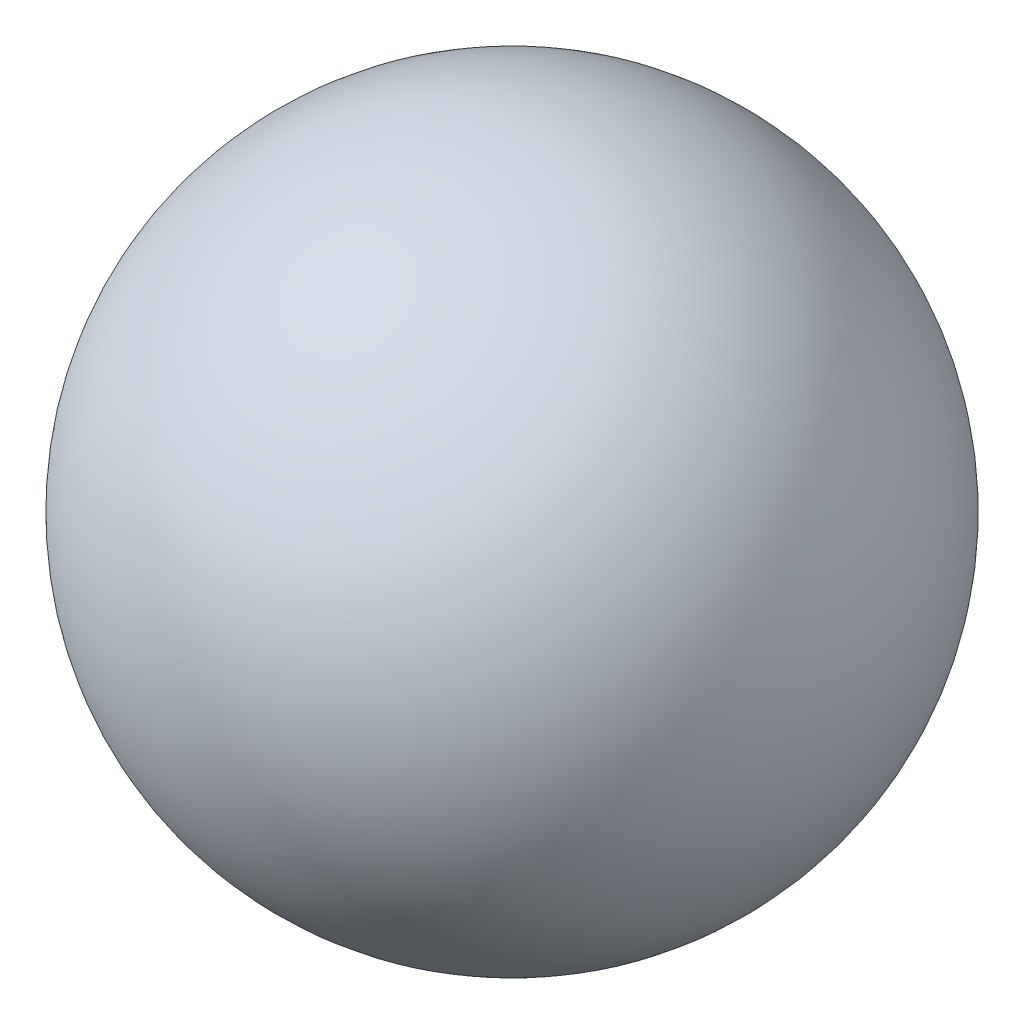
ISO-10303-21;
HEADER;
FILE_DESCRIPTION(('STEP AP214'),'2;1');
FILE_NAME('part.step','',(''),(''),'','','');
FILE_SCHEMA(('AUTOMOTIVE_DESIGN { 1 0 10303 214 1 1 1 1 }'));
ENDSEC;
DATA;
#1=APPLICATION_CONTEXT('core data for automotive mechanical design processes');
#2=APPLICATION_PROTOCOL_DEFINITION('international standard','automotive_design',2000,#1);
#3=PRODUCT_CONTEXT('',#1,'mechanical');
#4=PRODUCT('Part','Part','',(#3));
#5=PRODUCT_RELATED_PRODUCT_CATEGORY('part','',(#4));
#6=PRODUCT_DEFINITION_FORMATION('','',#4);
#7=PRODUCT_DEFINITION_CONTEXT('part definition',#1,'design');
#8=PRODUCT_DEFINITION('design','',#6,#7);
#9=PRODUCT_DEFINITION_SHAPE('','',#8);
#10=(LENGTH_UNIT() NAMED_UNIT(*) SI_UNIT(.MILLI.,.METRE.));
#11=(NAMED_UNIT(*) PLANE_ANGLE_UNIT() SI_UNIT($,.RADIAN.));
#12=(NAMED_UNIT(*) SI_UNIT($,.STERADIAN.) SOLID_ANGLE_UNIT());
#13=UNCERTAINTY_MEASURE_WITH_UNIT(LENGTH_MEASURE(1.E-05),#10,'distance_accuracy_value','');
#14=(GEOMETRIC_REPRESENTATION_CONTEXT(3) GLOBAL_UNCERTAINTY_ASSIGNED_CONTEXT((#13)) GLOBAL_UNIT_ASSIGNED_CONTEXT((#10,
#11,#12)) REPRESENTATION_CONTEXT('',''));
#15=CARTESIAN_POINT('',(0.,0.,0.));
#16=DIRECTION('',(0.,0.,1.));
#17=DIRECTION('',(1.,0.,0.));
#18=AXIS2_PLACEMENT_3D('',#15,#16,#17);
#19=CARTESIAN_POINT('',(0.,0.,0.));
#20=DIRECTION('',(0.,1.,0.));
#21=DIRECTION('',(1.,0.,0.));
#22=AXIS2_PLACEMENT_3D('',#19,#20,#21);
#23=SPHERICAL_SURFACE('',#22,127.);
#24=CARTESIAN_POINT('',(0.,127.,0.));
#25=VERTEX_POINT('',#24);
#26=VERTEX_LOOP('',#25);
#27=FACE_BOUND('',#26,.T.);
#28=ADVANCED_FACE('F29',(#27),#23,.T.);
#29=CLOSED_SHELL('',(#28));
#30=MANIFOLD_SOLID_BREP('B2',#29);
#31=ADVANCED_BREP_SHAPE_REPRESENTATION('',(#18,#30),#14);
#32=SHAPE_DEFINITION_REPRESENTATION(#9,#31);
ENDSEC;
END-ISO-10303-21;
